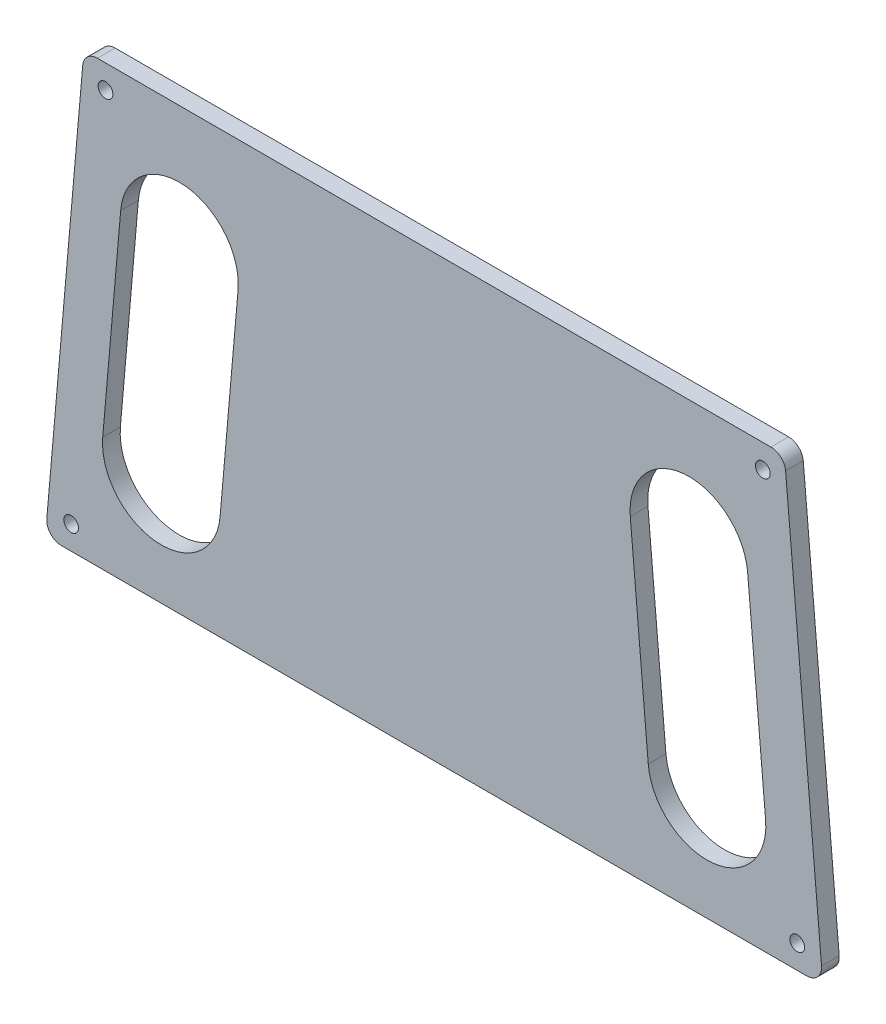
ISO-10303-21;
HEADER;
FILE_DESCRIPTION(('STEP AP214'),'2;1');
FILE_NAME('part.step','',(''),(''),'','','');
FILE_SCHEMA(('AUTOMOTIVE_DESIGN { 1 0 10303 214 1 1 1 1 }'));
ENDSEC;
DATA;
#1=APPLICATION_CONTEXT('core data for automotive mechanical design processes');
#2=APPLICATION_PROTOCOL_DEFINITION('international standard','automotive_design',2000,#1);
#3=PRODUCT_CONTEXT('',#1,'mechanical');
#4=PRODUCT('Part','Part','',(#3));
#5=PRODUCT_RELATED_PRODUCT_CATEGORY('part','',(#4));
#6=PRODUCT_DEFINITION_FORMATION('','',#4);
#7=PRODUCT_DEFINITION_CONTEXT('part definition',#1,'design');
#8=PRODUCT_DEFINITION('design','',#6,#7);
#9=PRODUCT_DEFINITION_SHAPE('','',#8);
#10=(LENGTH_UNIT() NAMED_UNIT(*) SI_UNIT(.MILLI.,.METRE.));
#11=(NAMED_UNIT(*) PLANE_ANGLE_UNIT() SI_UNIT($,.RADIAN.));
#12=(NAMED_UNIT(*) SI_UNIT($,.STERADIAN.) SOLID_ANGLE_UNIT());
#13=UNCERTAINTY_MEASURE_WITH_UNIT(LENGTH_MEASURE(1.E-05),#10,'distance_accuracy_value','');
#14=(GEOMETRIC_REPRESENTATION_CONTEXT(3) GLOBAL_UNCERTAINTY_ASSIGNED_CONTEXT((#13)) GLOBAL_UNIT_ASSIGNED_CONTEXT((#10,
#11,#12)) REPRESENTATION_CONTEXT('',''));
#15=CARTESIAN_POINT('',(0.,0.,0.));
#16=DIRECTION('',(0.,0.,1.));
#17=DIRECTION('',(1.,0.,0.));
#18=AXIS2_PLACEMENT_3D('',#15,#16,#17);
#19=CARTESIAN_POINT('',(57.1724913772606,72.2146023702589,8.));
#20=DIRECTION('',(0.,0.,1.));
#21=DIRECTION('',(1.,0.,0.));
#22=AXIS2_PLACEMENT_3D('',#19,#20,#21);
#23=CYLINDRICAL_SURFACE('',#22,2.4999999966347);
#24=CARTESIAN_POINT('',(57.1724913772606,72.2146023702589,11.));
#25=DIRECTION('',(0.,0.,1.));
#26=DIRECTION('',(1.,0.,0.));
#27=AXIS2_PLACEMENT_3D('',#24,#25,#26);
#28=CIRCLE('',#27,2.4999999966347);
#29=CARTESIAN_POINT('',(59.6629781190263,72.4324917281056,11.));
#30=VERTEX_POINT('',#29);
#31=CARTESIAN_POINT('',(57.1724913772606,74.7146023668936,11.));
#32=VERTEX_POINT('',#31);
#33=EDGE_CURVE('E236',#30,#32,#28,.T.);
#34=ORIENTED_EDGE('',*,*,#33,.F.);
#35=DIRECTION('',(0.,0.,1.));
#36=VECTOR('',#35,1.);
#37=CARTESIAN_POINT('',(59.6629781190263,72.4324917281056,8.));
#38=LINE('',#37,#36);
#39=CARTESIAN_POINT('',(59.6629781190263,72.4324917281056,8.));
#40=VERTEX_POINT('',#39);
#41=EDGE_CURVE('E11',#40,#30,#38,.T.);
#42=ORIENTED_EDGE('',*,*,#41,.F.);
#43=CARTESIAN_POINT('',(57.1724913772606,72.2146023702589,8.));
#44=DIRECTION('',(0.,0.,1.));
#45=DIRECTION('',(1.,0.,0.));
#46=AXIS2_PLACEMENT_3D('',#43,#44,#45);
#47=CIRCLE('',#46,2.4999999966347);
#48=CARTESIAN_POINT('',(57.1724913772606,74.7146023668936,8.));
#49=VERTEX_POINT('',#48);
#50=EDGE_CURVE('E239',#40,#49,#47,.T.);
#51=ORIENTED_EDGE('',*,*,#50,.T.);
#52=DIRECTION('',(0.,0.,1.));
#53=VECTOR('',#52,1.);
#54=CARTESIAN_POINT('',(57.1724913772606,74.7146023668936,8.));
#55=LINE('',#54,#53);
#56=EDGE_CURVE('E36',#49,#32,#55,.T.);
#57=ORIENTED_EDGE('',*,*,#56,.T.);
#58=EDGE_LOOP('',(#34,#42,#51,#57));
#59=FACE_BOUND('',#58,.T.);
#60=ADVANCED_FACE('F33',(#59),#23,.T.);
#61=CARTESIAN_POINT('',(65.7622155430567,2.71788937419446,8.));
#62=DIRECTION('',(0.996194698047273,0.0871557432559857,0.));
#63=DIRECTION('',(-0.0871557432559857,0.996194698047273,0.));
#64=AXIS2_PLACEMENT_3D('',#61,#62,#63);
#65=PLANE('',#64);
#66=DIRECTION('',(-0.0871557432559857,0.996194698047273,0.));
#67=VECTOR('',#66,1.);
#68=CARTESIAN_POINT('',(65.7622155430567,2.71788937419446,11.));
#69=LINE('',#68,#67);
#70=CARTESIAN_POINT('',(65.7622155430567,2.71788937419446,11.));
#71=VERTEX_POINT('',#70);
#72=EDGE_CURVE('E243',#71,#30,#69,.T.);
#73=ORIENTED_EDGE('',*,*,#72,.F.);
#74=DIRECTION('',(0.,0.,1.));
#75=VECTOR('',#74,1.);
#76=CARTESIAN_POINT('',(65.7622155430567,2.71788937419446,8.));
#77=LINE('',#76,#75);
#78=CARTESIAN_POINT('',(65.7622155430567,2.71788937419446,8.));
#79=VERTEX_POINT('',#78);
#80=EDGE_CURVE('E41',#79,#71,#77,.T.);
#81=ORIENTED_EDGE('',*,*,#80,.F.);
#82=DIRECTION('',(-0.0871557432559857,0.996194698047273,0.));
#83=VECTOR('',#82,1.);
#84=CARTESIAN_POINT('',(65.7622155430567,2.71788937419446,8.));
#85=LINE('',#84,#83);
#86=EDGE_CURVE('E261',#79,#40,#85,.T.);
#87=ORIENTED_EDGE('',*,*,#86,.T.);
#88=ORIENTED_EDGE('',*,*,#41,.T.);
#89=EDGE_LOOP('',(#73,#81,#87,#88));
#90=FACE_BOUND('',#89,.T.);
#91=ADVANCED_FACE('F308',(#90),#65,.T.);
#92=CARTESIAN_POINT('',(63.2717287832273,2.50000001476743,8.));
#93=DIRECTION('',(0.,0.,1.));
#94=DIRECTION('',(1.,0.,0.));
#95=AXIS2_PLACEMENT_3D('',#92,#93,#94);
#96=CYLINDRICAL_SURFACE('',#95,2.50000001476742);
#97=CARTESIAN_POINT('',(63.2717287832273,2.50000001476743,11.));
#98=DIRECTION('',(0.,0.,1.));
#99=DIRECTION('',(1.,0.,0.));
#100=AXIS2_PLACEMENT_3D('',#97,#98,#99);
#101=CIRCLE('',#100,2.50000001476742);
#102=CARTESIAN_POINT('',(63.2717287832273,0.,11.));
#103=VERTEX_POINT('',#102);
#104=EDGE_CURVE('E281',#103,#71,#101,.T.);
#105=ORIENTED_EDGE('',*,*,#104,.F.);
#106=DIRECTION('',(0.,0.,1.));
#107=VECTOR('',#106,1.);
#108=CARTESIAN_POINT('',(63.2717287832273,0.,8.));
#109=LINE('',#108,#107);
#110=CARTESIAN_POINT('',(63.2717287832273,0.,8.));
#111=VERTEX_POINT('',#110);
#112=EDGE_CURVE('E287',#111,#103,#109,.T.);
#113=ORIENTED_EDGE('',*,*,#112,.F.);
#114=CARTESIAN_POINT('',(63.2717287832273,2.50000001476743,8.));
#115=DIRECTION('',(0.,0.,1.));
#116=DIRECTION('',(1.,0.,0.));
#117=AXIS2_PLACEMENT_3D('',#114,#115,#116);
#118=CIRCLE('',#117,2.50000001476742);
#119=EDGE_CURVE('E258',#111,#79,#118,.T.);
#120=ORIENTED_EDGE('',*,*,#119,.T.);
#121=ORIENTED_EDGE('',*,*,#80,.T.);
#122=EDGE_LOOP('',(#105,#113,#120,#121));
#123=FACE_BOUND('',#122,.T.);
#124=ADVANCED_FACE('F328',(#123),#96,.T.);
#125=CARTESIAN_POINT('',(-63.271728747,0.,8.));
#126=DIRECTION('',(0.,-1.,0.));
#127=DIRECTION('',(1.,0.,0.));
#128=AXIS2_PLACEMENT_3D('',#125,#126,#127);
#129=PLANE('',#128);
#130=DIRECTION('',(1.,0.,0.));
#131=VECTOR('',#130,1.);
#132=CARTESIAN_POINT('',(-63.271728747,0.,11.));
#133=LINE('',#132,#131);
#134=CARTESIAN_POINT('',(-63.271728747,0.,11.));
#135=VERTEX_POINT('',#134);
#136=EDGE_CURVE('E278',#135,#103,#133,.T.);
#137=ORIENTED_EDGE('',*,*,#136,.F.);
#138=DIRECTION('',(0.,0.,1.));
#139=VECTOR('',#138,1.);
#140=CARTESIAN_POINT('',(-63.271728747,0.,8.));
#141=LINE('',#140,#139);
#142=CARTESIAN_POINT('',(-63.271728747,0.,8.));
#143=VERTEX_POINT('',#142);
#144=EDGE_CURVE('E289',#143,#135,#141,.T.);
#145=ORIENTED_EDGE('',*,*,#144,.F.);
#146=DIRECTION('',(1.,0.,0.));
#147=VECTOR('',#146,1.);
#148=CARTESIAN_POINT('',(-63.271728747,0.,8.));
#149=LINE('',#148,#147);
#150=EDGE_CURVE('E255',#143,#111,#149,.T.);
#151=ORIENTED_EDGE('',*,*,#150,.T.);
#152=ORIENTED_EDGE('',*,*,#112,.T.);
#153=EDGE_LOOP('',(#137,#145,#151,#152));
#154=FACE_BOUND('',#153,.T.);
#155=ADVANCED_FACE('F326',(#154),#129,.T.);
#156=CARTESIAN_POINT('',(-63.271728747,2.50000001491075,8.));
#157=DIRECTION('',(0.,0.,1.));
#158=DIRECTION('',(1.,0.,0.));
#159=AXIS2_PLACEMENT_3D('',#156,#157,#158);
#160=CYLINDRICAL_SURFACE('',#159,2.50000001491074);
#161=CARTESIAN_POINT('',(-63.271728747,2.50000001491075,11.));
#162=DIRECTION('',(0.,0.,1.));
#163=DIRECTION('',(1.,0.,0.));
#164=AXIS2_PLACEMENT_3D('',#161,#162,#163);
#165=CIRCLE('',#164,2.50000001491074);
#166=CARTESIAN_POINT('',(-65.7622155069706,2.71788937436799,11.));
#167=VERTEX_POINT('',#166);
#168=EDGE_CURVE('E275',#167,#135,#165,.T.);
#169=ORIENTED_EDGE('',*,*,#168,.F.);
#170=DIRECTION('',(0.,0.,1.));
#171=VECTOR('',#170,1.);
#172=CARTESIAN_POINT('',(-65.7622155069706,2.71788937436799,8.));
#173=LINE('',#172,#171);
#174=CARTESIAN_POINT('',(-65.7622155069706,2.71788937436799,8.));
#175=VERTEX_POINT('',#174);
#176=EDGE_CURVE('E291',#175,#167,#173,.T.);
#177=ORIENTED_EDGE('',*,*,#176,.F.);
#178=CARTESIAN_POINT('',(-63.271728747,2.50000001491075,8.));
#179=DIRECTION('',(0.,0.,1.));
#180=DIRECTION('',(1.,0.,0.));
#181=AXIS2_PLACEMENT_3D('',#178,#179,#180);
#182=CIRCLE('',#181,2.50000001491074);
#183=EDGE_CURVE('E252',#175,#143,#182,.T.);
#184=ORIENTED_EDGE('',*,*,#183,.T.);
#185=ORIENTED_EDGE('',*,*,#144,.T.);
#186=EDGE_LOOP('',(#169,#177,#184,#185));
#187=FACE_BOUND('',#186,.T.);
#188=ADVANCED_FACE('F322',(#187),#160,.T.);
#189=CARTESIAN_POINT('',(-59.6629780824495,72.4324917281728,8.));
#190=DIRECTION('',(-0.996194698046652,0.0871557432630763,0.));
#191=DIRECTION('',(-0.0871557432630763,-0.996194698046652,0.));
#192=AXIS2_PLACEMENT_3D('',#189,#190,#191);
#193=PLANE('',#192);
#194=DIRECTION('',(-0.0871557432630763,-0.996194698046652,0.));
#195=VECTOR('',#194,1.);
#196=CARTESIAN_POINT('',(-59.6629780824495,72.4324917281728,11.));
#197=LINE('',#196,#195);
#198=CARTESIAN_POINT('',(-59.6629780824495,72.4324917281728,11.));
#199=VERTEX_POINT('',#198);
#200=EDGE_CURVE('E272',#199,#167,#197,.T.);
#201=ORIENTED_EDGE('',*,*,#200,.F.);
#202=DIRECTION('',(0.,0.,1.));
#203=VECTOR('',#202,1.);
#204=CARTESIAN_POINT('',(-59.6629780824495,72.4324917281728,8.));
#205=LINE('',#204,#203);
#206=CARTESIAN_POINT('',(-59.6629780824495,72.4324917281728,8.));
#207=VERTEX_POINT('',#206);
#208=EDGE_CURVE('E293',#207,#199,#205,.T.);
#209=ORIENTED_EDGE('',*,*,#208,.F.);
#210=DIRECTION('',(-0.0871557432630763,-0.996194698046652,0.));
#211=VECTOR('',#210,1.);
#212=CARTESIAN_POINT('',(-59.6629780824495,72.4324917281728,8.));
#213=LINE('',#212,#211);
#214=EDGE_CURVE('E249',#207,#175,#213,.T.);
#215=ORIENTED_EDGE('',*,*,#214,.T.);
#216=ORIENTED_EDGE('',*,*,#176,.T.);
#217=EDGE_LOOP('',(#201,#209,#215,#216));
#218=FACE_BOUND('',#217,.T.);
#219=ADVANCED_FACE('F320',(#218),#193,.T.);
#220=CARTESIAN_POINT('',(-57.1724913407394,72.2146023703132,8.));
#221=DIRECTION('',(0.,0.,1.));
#222=DIRECTION('',(1.,0.,0.));
#223=AXIS2_PLACEMENT_3D('',#220,#221,#222);
#224=CYLINDRICAL_SURFACE('',#223,2.49999999658043);
#225=CARTESIAN_POINT('',(-57.1724913407394,72.2146023703132,11.));
#226=DIRECTION('',(0.,0.,1.));
#227=DIRECTION('',(1.,0.,0.));
#228=AXIS2_PLACEMENT_3D('',#225,#226,#227);
#229=CIRCLE('',#228,2.49999999658043);
#230=CARTESIAN_POINT('',(-57.1724913407394,74.7146023668936,11.));
#231=VERTEX_POINT('',#230);
#232=EDGE_CURVE('E269',#231,#199,#229,.T.);
#233=ORIENTED_EDGE('',*,*,#232,.F.);
#234=DIRECTION('',(0.,0.,1.));
#235=VECTOR('',#234,1.);
#236=CARTESIAN_POINT('',(-57.1724913407394,74.7146023668936,8.));
#237=LINE('',#236,#235);
#238=CARTESIAN_POINT('',(-57.1724913407394,74.7146023668936,8.));
#239=VERTEX_POINT('',#238);
#240=EDGE_CURVE('E294',#239,#231,#237,.T.);
#241=ORIENTED_EDGE('',*,*,#240,.F.);
#242=CARTESIAN_POINT('',(-57.1724913407394,72.2146023703132,8.));
#243=DIRECTION('',(0.,0.,1.));
#244=DIRECTION('',(1.,0.,0.));
#245=AXIS2_PLACEMENT_3D('',#242,#243,#244);
#246=CIRCLE('',#245,2.49999999658043);
#247=EDGE_CURVE('E246',#239,#207,#246,.T.);
#248=ORIENTED_EDGE('',*,*,#247,.T.);
#249=ORIENTED_EDGE('',*,*,#208,.T.);
#250=EDGE_LOOP('',(#233,#241,#248,#249));
#251=FACE_BOUND('',#250,.T.);
#252=ADVANCED_FACE('F316',(#251),#224,.T.);
#253=CARTESIAN_POINT('',(57.1724913772606,74.7146023668936,8.));
#254=DIRECTION('',(0.,1.,0.));
#255=DIRECTION('',(-1.,0.,0.));
#256=AXIS2_PLACEMENT_3D('',#253,#254,#255);
#257=PLANE('',#256);
#258=DIRECTION('',(-1.,0.,0.));
#259=VECTOR('',#258,1.);
#260=CARTESIAN_POINT('',(57.1724913772606,74.7146023668936,11.));
#261=LINE('',#260,#259);
#262=EDGE_CURVE('E266',#32,#231,#261,.T.);
#263=ORIENTED_EDGE('',*,*,#262,.F.);
#264=ORIENTED_EDGE('',*,*,#56,.F.);
#265=DIRECTION('',(-1.,0.,0.));
#266=VECTOR('',#265,1.);
#267=CARTESIAN_POINT('',(57.1724913772606,74.7146023668936,8.));
#268=LINE('',#267,#266);
#269=EDGE_CURVE('E242',#49,#239,#268,.T.);
#270=ORIENTED_EDGE('',*,*,#269,.T.);
#271=ORIENTED_EDGE('',*,*,#240,.T.);
#272=EDGE_LOOP('',(#263,#264,#270,#271));
#273=FACE_BOUND('',#272,.T.);
#274=ADVANCED_FACE('F302',(#273),#257,.T.);
#275=CARTESIAN_POINT('',(57.1724913772606,72.2146023702589,8.));
#276=DIRECTION('',(0.,0.,1.));
#277=DIRECTION('',(1.,0.,0.));
#278=AXIS2_PLACEMENT_3D('',#275,#276,#277);
#279=PLANE('',#278);
#280=DIRECTION('',(0.0871557429185674,0.996194698076793,0.));
#281=VECTOR('',#280,1.);
#282=CARTESIAN_POINT('',(-33.2939197273949,52.5682369504664,8.));
#283=LINE('',#282,#281);
#284=CARTESIAN_POINT('',(-36.3443707295251,17.7014225180027,8.));
#285=VERTEX_POINT('',#284);
#286=CARTESIAN_POINT('',(-33.2939197273949,52.5682369504664,8.));
#287=VERTEX_POINT('',#286);
#288=EDGE_CURVE('E154',#285,#287,#283,.T.);
#289=ORIENTED_EDGE('',*,*,#288,.T.);
#290=CARTESIAN_POINT('',(-43.2558667216451,53.4397943808316,8.));
#291=DIRECTION('',(0.,0.,1.));
#292=DIRECTION('',(-1.,0.,0.));
#293=AXIS2_PLACEMENT_3D('',#290,#291,#292);
#294=CIRCLE('',#293,10.0000000135338);
#295=CARTESIAN_POINT('',(-53.2178137160501,54.3113518094271,8.));
#296=VERTEX_POINT('',#295);
#297=EDGE_CURVE('E148',#287,#296,#294,.T.);
#298=ORIENTED_EDGE('',*,*,#297,.T.);
#299=DIRECTION('',(-0.0871557427415979,-0.996194698092276,0.));
#300=VECTOR('',#299,1.);
#301=CARTESIAN_POINT('',(-56.2682647119864,19.4445373764215,8.));
#302=LINE('',#301,#300);
#303=CARTESIAN_POINT('',(-56.2682647119864,19.4445373764215,8.));
#304=VERTEX_POINT('',#303);
#305=EDGE_CURVE('E157',#296,#304,#302,.T.);
#306=ORIENTED_EDGE('',*,*,#305,.T.);
#307=CARTESIAN_POINT('',(-46.3063177206784,18.572979948097,8.));
#308=DIRECTION('',(0.,0.,1.));
#309=DIRECTION('',(-1.,0.,0.));
#310=AXIS2_PLACEMENT_3D('',#307,#308,#309);
#311=CIRCLE('',#310,10.000000010425);
#312=EDGE_CURVE('E49',#304,#285,#311,.T.);
#313=ORIENTED_EDGE('',*,*,#312,.T.);
#314=EDGE_LOOP('',(#289,#298,#306,#313));
#315=FACE_BOUND('',#314,.T.);
#316=DIRECTION('',(-0.0871557429167473,0.996194698076952,0.));
#317=VECTOR('',#316,1.);
#318=CARTESIAN_POINT('',(53.2178137127576,54.311351810904,8.));
#319=LINE('',#318,#317);
#320=CARTESIAN_POINT('',(56.2682647148249,19.4445373784256,8.));
#321=VERTEX_POINT('',#320);
#322=CARTESIAN_POINT('',(53.2178137127576,54.311351810904,8.));
#323=VERTEX_POINT('',#322);
#324=EDGE_CURVE('E193',#321,#323,#319,.T.);
#325=ORIENTED_EDGE('',*,*,#324,.T.);
#326=CARTESIAN_POINT('',(43.2558667200653,53.4397943806934,8.));
#327=DIRECTION('',(0.,0.,1.));
#328=DIRECTION('',(-1.,0.,0.));
#329=AXIS2_PLACEMENT_3D('',#326,#327,#328);
#330=CIRCLE('',#329,10.0000000119683);
#331=CARTESIAN_POINT('',(33.2939197273746,52.5682369504646,8.));
#332=VERTEX_POINT('',#331);
#333=EDGE_CURVE('E183',#323,#332,#330,.T.);
#334=ORIENTED_EDGE('',*,*,#333,.T.);
#335=DIRECTION('',(0.0871557429185665,-0.996194698076793,0.));
#336=VECTOR('',#335,1.);
#337=CARTESIAN_POINT('',(36.3443707295056,17.7014225179918,8.));
#338=LINE('',#337,#336);
#339=CARTESIAN_POINT('',(36.3443707295056,17.7014225179918,8.));
#340=VERTEX_POINT('',#339);
#341=EDGE_CURVE('E186',#332,#340,#338,.T.);
#342=ORIENTED_EDGE('',*,*,#341,.T.);
#343=CARTESIAN_POINT('',(46.3063177221645,18.5729799482178,8.));
#344=DIRECTION('',(0.,0.,1.));
#345=DIRECTION('',(-1.,0.,0.));
#346=AXIS2_PLACEMENT_3D('',#343,#344,#345);
#347=CIRCLE('',#346,10.0000000119364);
#348=EDGE_CURVE('E190',#340,#321,#347,.T.);
#349=ORIENTED_EDGE('',*,*,#348,.T.);
#350=EDGE_LOOP('',(#325,#334,#342,#349));
#351=FACE_BOUND('',#350,.T.);
#352=CARTESIAN_POINT('',(61.634765996,4.,8.));
#353=DIRECTION('',(0.,0.,1.));
#354=DIRECTION('',(-1.,0.,0.));
#355=AXIS2_PLACEMENT_3D('',#352,#353,#354);
#356=CIRCLE('',#355,1.25000000000001);
#357=CARTESIAN_POINT('',(60.384765996,4.,8.));
#358=VERTEX_POINT('',#357);
#359=EDGE_CURVE('E215',#358,#358,#356,.T.);
#360=ORIENTED_EDGE('',*,*,#359,.T.);
#361=EDGE_LOOP('',(#360));
#362=FACE_BOUND('',#361,.T.);
#363=CARTESIAN_POINT('',(-55.797994598,70.714602357,8.));
#364=DIRECTION('',(0.,0.,1.));
#365=DIRECTION('',(-1.,0.,0.));
#366=AXIS2_PLACEMENT_3D('',#363,#364,#365);
#367=CIRCLE('',#366,1.24999999999999);
#368=CARTESIAN_POINT('',(-57.047994598,70.714602357,8.));
#369=VERTEX_POINT('',#368);
#370=EDGE_CURVE('E221',#369,#369,#367,.T.);
#371=ORIENTED_EDGE('',*,*,#370,.T.);
#372=EDGE_LOOP('',(#371));
#373=FACE_BOUND('',#372,.T.);
#374=CARTESIAN_POINT('',(-61.634765996,4.,8.));
#375=DIRECTION('',(0.,0.,1.));
#376=DIRECTION('',(-1.,0.,0.));
#377=AXIS2_PLACEMENT_3D('',#374,#375,#376);
#378=CIRCLE('',#377,1.24999999999999);
#379=CARTESIAN_POINT('',(-62.884765996,4.,8.));
#380=VERTEX_POINT('',#379);
#381=EDGE_CURVE('E227',#380,#380,#378,.T.);
#382=ORIENTED_EDGE('',*,*,#381,.T.);
#383=EDGE_LOOP('',(#382));
#384=FACE_BOUND('',#383,.T.);
#385=CARTESIAN_POINT('',(55.797994598,70.714602357,8.));
#386=DIRECTION('',(0.,0.,1.));
#387=DIRECTION('',(-1.,0.,0.));
#388=AXIS2_PLACEMENT_3D('',#385,#386,#387);
#389=CIRCLE('',#388,1.25);
#390=CARTESIAN_POINT('',(54.547994598,70.714602357,8.));
#391=VERTEX_POINT('',#390);
#392=EDGE_CURVE('E233',#391,#391,#389,.T.);
#393=ORIENTED_EDGE('',*,*,#392,.T.);
#394=EDGE_LOOP('',(#393));
#395=FACE_BOUND('',#394,.T.);
#396=ORIENTED_EDGE('',*,*,#50,.F.);
#397=ORIENTED_EDGE('',*,*,#86,.F.);
#398=ORIENTED_EDGE('',*,*,#119,.F.);
#399=ORIENTED_EDGE('',*,*,#150,.F.);
#400=ORIENTED_EDGE('',*,*,#183,.F.);
#401=ORIENTED_EDGE('',*,*,#214,.F.);
#402=ORIENTED_EDGE('',*,*,#247,.F.);
#403=ORIENTED_EDGE('',*,*,#269,.F.);
#404=EDGE_LOOP('',(#396,#397,#398,#399,#400,#401,#402,#403));
#405=FACE_BOUND('',#404,.T.);
#406=ADVANCED_FACE('F161',(#315,#351,#362,#373,#384,#395,#405),#279,.F.);
#407=CARTESIAN_POINT('',(57.1724913772606,72.2146023702589,11.));
#408=DIRECTION('',(0.,0.,1.));
#409=DIRECTION('',(1.,0.,0.));
#410=AXIS2_PLACEMENT_3D('',#407,#408,#409);
#411=PLANE('',#410);
#412=CARTESIAN_POINT('',(-43.2558667216451,53.4397943808316,11.));
#413=DIRECTION('',(0.,0.,1.));
#414=DIRECTION('',(-1.,0.,0.));
#415=AXIS2_PLACEMENT_3D('',#412,#413,#414);
#416=CIRCLE('',#415,10.0000000135338);
#417=CARTESIAN_POINT('',(-33.2939197273949,52.5682369504664,11.));
#418=VERTEX_POINT('',#417);
#419=CARTESIAN_POINT('',(-53.2178137160501,54.3113518094271,11.));
#420=VERTEX_POINT('',#419);
#421=EDGE_CURVE('E57',#418,#420,#416,.T.);
#422=ORIENTED_EDGE('',*,*,#421,.F.);
#423=DIRECTION('',(0.0871557429185674,0.996194698076793,0.));
#424=VECTOR('',#423,1.);
#425=CARTESIAN_POINT('',(-33.2939197273949,52.5682369504664,11.));
#426=LINE('',#425,#424);
#427=CARTESIAN_POINT('',(-36.3443707295251,17.7014225180027,11.));
#428=VERTEX_POINT('',#427);
#429=EDGE_CURVE('E164',#428,#418,#426,.T.);
#430=ORIENTED_EDGE('',*,*,#429,.F.);
#431=CARTESIAN_POINT('',(-46.3063177206784,18.572979948097,11.));
#432=DIRECTION('',(0.,0.,1.));
#433=DIRECTION('',(-1.,0.,0.));
#434=AXIS2_PLACEMENT_3D('',#431,#432,#433);
#435=CIRCLE('',#434,10.000000010425);
#436=CARTESIAN_POINT('',(-56.2682647119864,19.4445373764215,11.));
#437=VERTEX_POINT('',#436);
#438=EDGE_CURVE('E167',#437,#428,#435,.T.);
#439=ORIENTED_EDGE('',*,*,#438,.F.);
#440=DIRECTION('',(-0.0871557427415979,-0.996194698092276,0.));
#441=VECTOR('',#440,1.);
#442=CARTESIAN_POINT('',(-56.2682647119864,19.4445373764215,11.));
#443=LINE('',#442,#441);
#444=EDGE_CURVE('E173',#420,#437,#443,.T.);
#445=ORIENTED_EDGE('',*,*,#444,.F.);
#446=EDGE_LOOP('',(#422,#430,#439,#445));
#447=FACE_BOUND('',#446,.T.);
#448=CARTESIAN_POINT('',(43.2558667200653,53.4397943806934,11.));
#449=DIRECTION('',(0.,0.,1.));
#450=DIRECTION('',(-1.,0.,0.));
#451=AXIS2_PLACEMENT_3D('',#448,#449,#450);
#452=CIRCLE('',#451,10.0000000119683);
#453=CARTESIAN_POINT('',(53.2178137127576,54.311351810904,11.));
#454=VERTEX_POINT('',#453);
#455=CARTESIAN_POINT('',(33.2939197273746,52.5682369504646,11.));
#456=VERTEX_POINT('',#455);
#457=EDGE_CURVE('E179',#454,#456,#452,.T.);
#458=ORIENTED_EDGE('',*,*,#457,.F.);
#459=DIRECTION('',(-0.0871557429167473,0.996194698076952,0.));
#460=VECTOR('',#459,1.);
#461=CARTESIAN_POINT('',(53.2178137127576,54.311351810904,11.));
#462=LINE('',#461,#460);
#463=CARTESIAN_POINT('',(56.2682647148249,19.4445373784256,11.));
#464=VERTEX_POINT('',#463);
#465=EDGE_CURVE('E187',#464,#454,#462,.T.);
#466=ORIENTED_EDGE('',*,*,#465,.F.);
#467=CARTESIAN_POINT('',(46.3063177221645,18.5729799482178,11.));
#468=DIRECTION('',(0.,0.,1.));
#469=DIRECTION('',(-1.,0.,0.));
#470=AXIS2_PLACEMENT_3D('',#467,#468,#469);
#471=CIRCLE('',#470,10.0000000119364);
#472=CARTESIAN_POINT('',(36.3443707295056,17.7014225179918,11.));
#473=VERTEX_POINT('',#472);
#474=EDGE_CURVE('E201',#473,#464,#471,.T.);
#475=ORIENTED_EDGE('',*,*,#474,.F.);
#476=DIRECTION('',(0.0871557429185665,-0.996194698076793,0.));
#477=VECTOR('',#476,1.);
#478=CARTESIAN_POINT('',(36.3443707295056,17.7014225179918,11.));
#479=LINE('',#478,#477);
#480=EDGE_CURVE('E198',#456,#473,#479,.T.);
#481=ORIENTED_EDGE('',*,*,#480,.F.);
#482=EDGE_LOOP('',(#458,#466,#475,#481));
#483=FACE_BOUND('',#482,.T.);
#484=CARTESIAN_POINT('',(61.634765996,4.,11.));
#485=DIRECTION('',(0.,0.,1.));
#486=DIRECTION('',(-1.,0.,0.));
#487=AXIS2_PLACEMENT_3D('',#484,#485,#486);
#488=CIRCLE('',#487,1.25000000000001);
#489=CARTESIAN_POINT('',(60.384765996,4.,11.));
#490=VERTEX_POINT('',#489);
#491=EDGE_CURVE('E208',#490,#490,#488,.T.);
#492=ORIENTED_EDGE('',*,*,#491,.F.);
#493=EDGE_LOOP('',(#492));
#494=FACE_BOUND('',#493,.T.);
#495=CARTESIAN_POINT('',(-55.797994598,70.714602357,11.));
#496=DIRECTION('',(0.,0.,1.));
#497=DIRECTION('',(-1.,0.,0.));
#498=AXIS2_PLACEMENT_3D('',#495,#496,#497);
#499=CIRCLE('',#498,1.24999999999999);
#500=CARTESIAN_POINT('',(-57.047994598,70.714602357,11.));
#501=VERTEX_POINT('',#500);
#502=EDGE_CURVE('E218',#501,#501,#499,.T.);
#503=ORIENTED_EDGE('',*,*,#502,.F.);
#504=EDGE_LOOP('',(#503));
#505=FACE_BOUND('',#504,.T.);
#506=CARTESIAN_POINT('',(-61.634765996,4.,11.));
#507=DIRECTION('',(0.,0.,1.));
#508=DIRECTION('',(-1.,0.,0.));
#509=AXIS2_PLACEMENT_3D('',#506,#507,#508);
#510=CIRCLE('',#509,1.24999999999999);
#511=CARTESIAN_POINT('',(-62.884765996,4.,11.));
#512=VERTEX_POINT('',#511);
#513=EDGE_CURVE('E224',#512,#512,#510,.T.);
#514=ORIENTED_EDGE('',*,*,#513,.F.);
#515=EDGE_LOOP('',(#514));
#516=FACE_BOUND('',#515,.T.);
#517=CARTESIAN_POINT('',(55.797994598,70.714602357,11.));
#518=DIRECTION('',(0.,0.,1.));
#519=DIRECTION('',(-1.,0.,0.));
#520=AXIS2_PLACEMENT_3D('',#517,#518,#519);
#521=CIRCLE('',#520,1.25);
#522=CARTESIAN_POINT('',(54.547994598,70.714602357,11.));
#523=VERTEX_POINT('',#522);
#524=EDGE_CURVE('E230',#523,#523,#521,.T.);
#525=ORIENTED_EDGE('',*,*,#524,.F.);
#526=EDGE_LOOP('',(#525));
#527=FACE_BOUND('',#526,.T.);
#528=ORIENTED_EDGE('',*,*,#33,.T.);
#529=ORIENTED_EDGE('',*,*,#262,.T.);
#530=ORIENTED_EDGE('',*,*,#232,.T.);
#531=ORIENTED_EDGE('',*,*,#200,.T.);
#532=ORIENTED_EDGE('',*,*,#168,.T.);
#533=ORIENTED_EDGE('',*,*,#136,.T.);
#534=ORIENTED_EDGE('',*,*,#104,.T.);
#535=ORIENTED_EDGE('',*,*,#72,.T.);
#536=EDGE_LOOP('',(#528,#529,#530,#531,#532,#533,#534,#535));
#537=FACE_BOUND('',#536,.T.);
#538=ADVANCED_FACE('F304',(#447,#483,#494,#505,#516,#527,#537),#411,.T.);
#539=CARTESIAN_POINT('',(55.797994598,70.714602357,8.));
#540=DIRECTION('',(0.,0.,1.));
#541=DIRECTION('',(1.,0.,0.));
#542=AXIS2_PLACEMENT_3D('',#539,#540,#541);
#543=CYLINDRICAL_SURFACE('',#542,1.25);
#544=ORIENTED_EDGE('',*,*,#392,.F.);
#545=EDGE_LOOP('',(#544));
#546=FACE_BOUND('',#545,.T.);
#547=ORIENTED_EDGE('',*,*,#524,.T.);
#548=EDGE_LOOP('',(#547));
#549=FACE_BOUND('',#548,.T.);
#550=ADVANCED_FACE('F402',(#546,#549),#543,.F.);
#551=CARTESIAN_POINT('',(-61.634765996,4.,8.));
#552=DIRECTION('',(0.,0.,1.));
#553=DIRECTION('',(1.,0.,0.));
#554=AXIS2_PLACEMENT_3D('',#551,#552,#553);
#555=CYLINDRICAL_SURFACE('',#554,1.24999999999999);
#556=ORIENTED_EDGE('',*,*,#381,.F.);
#557=EDGE_LOOP('',(#556));
#558=FACE_BOUND('',#557,.T.);
#559=ORIENTED_EDGE('',*,*,#513,.T.);
#560=EDGE_LOOP('',(#559));
#561=FACE_BOUND('',#560,.T.);
#562=ADVANCED_FACE('F412',(#558,#561),#555,.F.);
#563=CARTESIAN_POINT('',(-55.797994598,70.714602357,8.));
#564=DIRECTION('',(0.,0.,1.));
#565=DIRECTION('',(1.,0.,0.));
#566=AXIS2_PLACEMENT_3D('',#563,#564,#565);
#567=CYLINDRICAL_SURFACE('',#566,1.24999999999999);
#568=ORIENTED_EDGE('',*,*,#370,.F.);
#569=EDGE_LOOP('',(#568));
#570=FACE_BOUND('',#569,.T.);
#571=ORIENTED_EDGE('',*,*,#502,.T.);
#572=EDGE_LOOP('',(#571));
#573=FACE_BOUND('',#572,.T.);
#574=ADVANCED_FACE('F422',(#570,#573),#567,.F.);
#575=CARTESIAN_POINT('',(61.634765996,4.,8.));
#576=DIRECTION('',(0.,0.,1.));
#577=DIRECTION('',(1.,0.,0.));
#578=AXIS2_PLACEMENT_3D('',#575,#576,#577);
#579=CYLINDRICAL_SURFACE('',#578,1.25000000000001);
#580=ORIENTED_EDGE('',*,*,#359,.F.);
#581=EDGE_LOOP('',(#580));
#582=FACE_BOUND('',#581,.T.);
#583=ORIENTED_EDGE('',*,*,#491,.T.);
#584=EDGE_LOOP('',(#583));
#585=FACE_BOUND('',#584,.T.);
#586=ADVANCED_FACE('F432',(#582,#585),#579,.F.);
#587=CARTESIAN_POINT('',(43.2558667200653,53.4397943806934,8.));
#588=DIRECTION('',(0.,0.,1.));
#589=DIRECTION('',(1.,0.,0.));
#590=AXIS2_PLACEMENT_3D('',#587,#588,#589);
#591=CYLINDRICAL_SURFACE('',#590,10.0000000119683);
#592=ORIENTED_EDGE('',*,*,#457,.T.);
#593=DIRECTION('',(0.,0.,1.));
#594=VECTOR('',#593,1.);
#595=CARTESIAN_POINT('',(33.2939197273746,52.5682369504646,8.));
#596=LINE('',#595,#594);
#597=EDGE_CURVE('E196',#332,#456,#596,.T.);
#598=ORIENTED_EDGE('',*,*,#597,.F.);
#599=ORIENTED_EDGE('',*,*,#333,.F.);
#600=DIRECTION('',(0.,0.,1.));
#601=VECTOR('',#600,1.);
#602=CARTESIAN_POINT('',(53.2178137127576,54.311351810904,8.));
#603=LINE('',#602,#601);
#604=EDGE_CURVE('E206',#323,#454,#603,.T.);
#605=ORIENTED_EDGE('',*,*,#604,.T.);
#606=EDGE_LOOP('',(#592,#598,#599,#605));
#607=FACE_BOUND('',#606,.T.);
#608=ADVANCED_FACE('F442',(#607),#591,.F.);
#609=CARTESIAN_POINT('',(53.2178137127576,54.311351810904,8.));
#610=DIRECTION('',(0.996194698076952,0.0871557429167473,0.));
#611=DIRECTION('',(-0.0871557429167473,0.996194698076952,0.));
#612=AXIS2_PLACEMENT_3D('',#609,#610,#611);
#613=PLANE('',#612);
#614=ORIENTED_EDGE('',*,*,#465,.T.);
#615=ORIENTED_EDGE('',*,*,#604,.F.);
#616=ORIENTED_EDGE('',*,*,#324,.F.);
#617=DIRECTION('',(0.,0.,1.));
#618=VECTOR('',#617,1.);
#619=CARTESIAN_POINT('',(56.2682647148249,19.4445373784256,8.));
#620=LINE('',#619,#618);
#621=EDGE_CURVE('E209',#321,#464,#620,.T.);
#622=ORIENTED_EDGE('',*,*,#621,.T.);
#623=EDGE_LOOP('',(#614,#615,#616,#622));
#624=FACE_BOUND('',#623,.T.);
#625=ADVANCED_FACE('F452',(#624),#613,.F.);
#626=CARTESIAN_POINT('',(46.3063177221645,18.5729799482178,8.));
#627=DIRECTION('',(0.,0.,1.));
#628=DIRECTION('',(1.,0.,0.));
#629=AXIS2_PLACEMENT_3D('',#626,#627,#628);
#630=CYLINDRICAL_SURFACE('',#629,10.0000000119364);
#631=ORIENTED_EDGE('',*,*,#474,.T.);
#632=ORIENTED_EDGE('',*,*,#621,.F.);
#633=ORIENTED_EDGE('',*,*,#348,.F.);
#634=DIRECTION('',(0.,0.,1.));
#635=VECTOR('',#634,1.);
#636=CARTESIAN_POINT('',(36.3443707295056,17.7014225179918,8.));
#637=LINE('',#636,#635);
#638=EDGE_CURVE('E211',#340,#473,#637,.T.);
#639=ORIENTED_EDGE('',*,*,#638,.T.);
#640=EDGE_LOOP('',(#631,#632,#633,#639));
#641=FACE_BOUND('',#640,.T.);
#642=ADVANCED_FACE('F462',(#641),#630,.F.);
#643=CARTESIAN_POINT('',(36.3443707295056,17.7014225179918,8.));
#644=DIRECTION('',(-0.996194698076793,-0.0871557429185665,0.));
#645=DIRECTION('',(0.0871557429185665,-0.996194698076793,0.));
#646=AXIS2_PLACEMENT_3D('',#643,#644,#645);
#647=PLANE('',#646);
#648=ORIENTED_EDGE('',*,*,#480,.T.);
#649=ORIENTED_EDGE('',*,*,#638,.F.);
#650=ORIENTED_EDGE('',*,*,#341,.F.);
#651=ORIENTED_EDGE('',*,*,#597,.T.);
#652=EDGE_LOOP('',(#648,#649,#650,#651));
#653=FACE_BOUND('',#652,.T.);
#654=ADVANCED_FACE('F472',(#653),#647,.F.);
#655=CARTESIAN_POINT('',(-43.2558667216451,53.4397943808316,8.));
#656=DIRECTION('',(0.,0.,1.));
#657=DIRECTION('',(1.,0.,0.));
#658=AXIS2_PLACEMENT_3D('',#655,#656,#657);
#659=CYLINDRICAL_SURFACE('',#658,10.0000000135338);
#660=ORIENTED_EDGE('',*,*,#421,.T.);
#661=DIRECTION('',(0.,0.,1.));
#662=VECTOR('',#661,1.);
#663=CARTESIAN_POINT('',(-53.2178137160501,54.3113518094271,8.));
#664=LINE('',#663,#662);
#665=EDGE_CURVE('E144',#296,#420,#664,.T.);
#666=ORIENTED_EDGE('',*,*,#665,.F.);
#667=ORIENTED_EDGE('',*,*,#297,.F.);
#668=DIRECTION('',(0.,0.,1.));
#669=VECTOR('',#668,1.);
#670=CARTESIAN_POINT('',(-33.2939197273949,52.5682369504664,8.));
#671=LINE('',#670,#669);
#672=EDGE_CURVE('E177',#287,#418,#671,.T.);
#673=ORIENTED_EDGE('',*,*,#672,.T.);
#674=EDGE_LOOP('',(#660,#666,#667,#673));
#675=FACE_BOUND('',#674,.T.);
#676=ADVANCED_FACE('F146',(#675),#659,.F.);
#677=CARTESIAN_POINT('',(-33.2939197273949,52.5682369504664,8.));
#678=DIRECTION('',(0.996194698076793,-0.0871557429185674,0.));
#679=DIRECTION('',(0.0871557429185674,0.996194698076793,0.));
#680=AXIS2_PLACEMENT_3D('',#677,#678,#679);
#681=PLANE('',#680);
#682=ORIENTED_EDGE('',*,*,#429,.T.);
#683=ORIENTED_EDGE('',*,*,#672,.F.);
#684=ORIENTED_EDGE('',*,*,#288,.F.);
#685=DIRECTION('',(0.,0.,1.));
#686=VECTOR('',#685,1.);
#687=CARTESIAN_POINT('',(-36.3443707295251,17.7014225180027,8.));
#688=LINE('',#687,#686);
#689=EDGE_CURVE('E180',#285,#428,#688,.T.);
#690=ORIENTED_EDGE('',*,*,#689,.T.);
#691=EDGE_LOOP('',(#682,#683,#684,#690));
#692=FACE_BOUND('',#691,.T.);
#693=ADVANCED_FACE('F491',(#692),#681,.F.);
#694=CARTESIAN_POINT('',(-46.3063177206784,18.572979948097,8.));
#695=DIRECTION('',(0.,0.,1.));
#696=DIRECTION('',(1.,0.,0.));
#697=AXIS2_PLACEMENT_3D('',#694,#695,#696);
#698=CYLINDRICAL_SURFACE('',#697,10.000000010425);
#699=ORIENTED_EDGE('',*,*,#438,.T.);
#700=ORIENTED_EDGE('',*,*,#689,.F.);
#701=ORIENTED_EDGE('',*,*,#312,.F.);
#702=DIRECTION('',(0.,0.,1.));
#703=VECTOR('',#702,1.);
#704=CARTESIAN_POINT('',(-56.2682647119864,19.4445373764215,8.));
#705=LINE('',#704,#703);
#706=EDGE_CURVE('E153',#304,#437,#705,.T.);
#707=ORIENTED_EDGE('',*,*,#706,.T.);
#708=EDGE_LOOP('',(#699,#700,#701,#707));
#709=FACE_BOUND('',#708,.T.);
#710=ADVANCED_FACE('F500',(#709),#698,.F.);
#711=CARTESIAN_POINT('',(-56.2682647119864,19.4445373764215,8.));
#712=DIRECTION('',(-0.996194698092276,0.0871557427415979,0.));
#713=DIRECTION('',(-0.0871557427415979,-0.996194698092276,0.));
#714=AXIS2_PLACEMENT_3D('',#711,#712,#713);
#715=PLANE('',#714);
#716=ORIENTED_EDGE('',*,*,#444,.T.);
#717=ORIENTED_EDGE('',*,*,#706,.F.);
#718=ORIENTED_EDGE('',*,*,#305,.F.);
#719=ORIENTED_EDGE('',*,*,#665,.T.);
#720=EDGE_LOOP('',(#716,#717,#718,#719));
#721=FACE_BOUND('',#720,.T.);
#722=ADVANCED_FACE('F158',(#721),#715,.F.);
#723=CLOSED_SHELL('',(#60,#91,#124,#155,#188,#219,#252,#274,#406,#538,#550,#562,#574,#586,#608,
#625,#642,#654,#676,#693,#710,#722));
#724=MANIFOLD_SOLID_BREP('B2',#723);
#725=ADVANCED_BREP_SHAPE_REPRESENTATION('',(#18,#724),#14);
#726=SHAPE_DEFINITION_REPRESENTATION(#9,#725);
ENDSEC;
END-ISO-10303-21;
